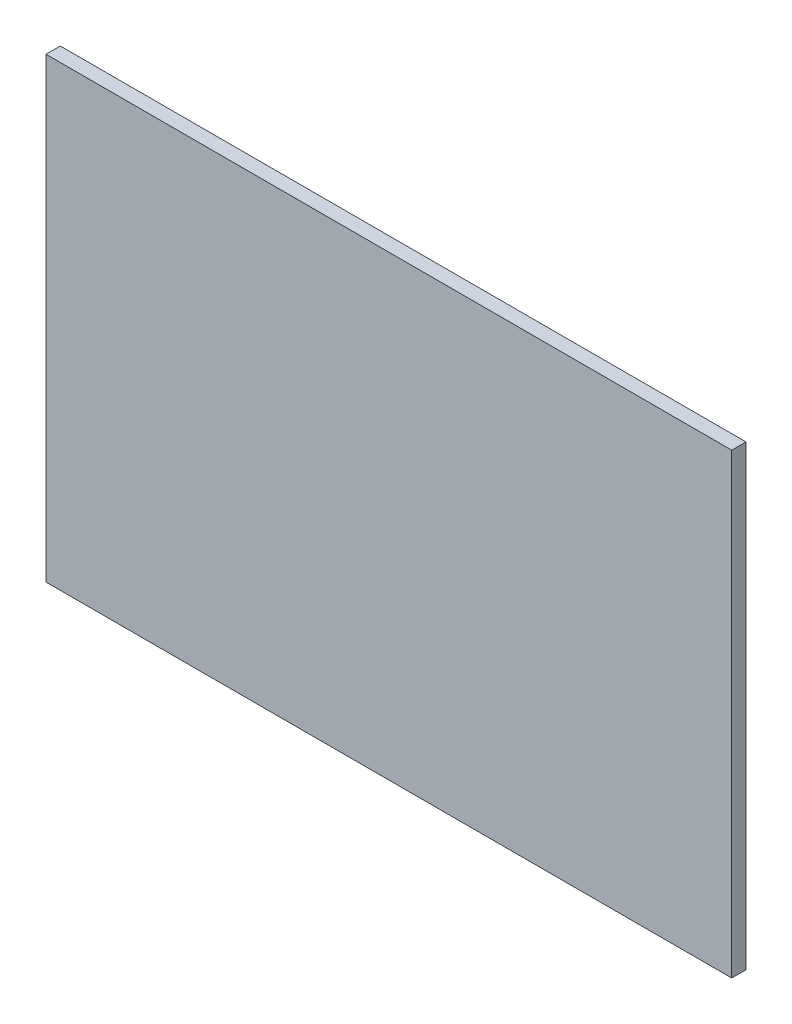
ISO-10303-21;
HEADER;
FILE_DESCRIPTION(('STEP AP214'),'2;1');
FILE_NAME('part.step','',(''),(''),'','','');
FILE_SCHEMA(('AUTOMOTIVE_DESIGN { 1 0 10303 214 1 1 1 1 }'));
ENDSEC;
DATA;
#1=APPLICATION_CONTEXT('core data for automotive mechanical design processes');
#2=APPLICATION_PROTOCOL_DEFINITION('international standard','automotive_design',2000,#1);
#3=PRODUCT_CONTEXT('',#1,'mechanical');
#4=PRODUCT('Part','Part','',(#3));
#5=PRODUCT_RELATED_PRODUCT_CATEGORY('part','',(#4));
#6=PRODUCT_DEFINITION_FORMATION('','',#4);
#7=PRODUCT_DEFINITION_CONTEXT('part definition',#1,'design');
#8=PRODUCT_DEFINITION('design','',#6,#7);
#9=PRODUCT_DEFINITION_SHAPE('','',#8);
#10=(LENGTH_UNIT() NAMED_UNIT(*) SI_UNIT(.MILLI.,.METRE.));
#11=(NAMED_UNIT(*) PLANE_ANGLE_UNIT() SI_UNIT($,.RADIAN.));
#12=(NAMED_UNIT(*) SI_UNIT($,.STERADIAN.) SOLID_ANGLE_UNIT());
#13=UNCERTAINTY_MEASURE_WITH_UNIT(LENGTH_MEASURE(1.E-05),#10,'distance_accuracy_value','');
#14=(GEOMETRIC_REPRESENTATION_CONTEXT(3) GLOBAL_UNCERTAINTY_ASSIGNED_CONTEXT((#13)) GLOBAL_UNIT_ASSIGNED_CONTEXT((#10,
#11,#12)) REPRESENTATION_CONTEXT('',''));
#15=CARTESIAN_POINT('',(0.,0.,0.));
#16=DIRECTION('',(0.,0.,1.));
#17=DIRECTION('',(1.,0.,0.));
#18=AXIS2_PLACEMENT_3D('',#15,#16,#17);
#19=CARTESIAN_POINT('',(0.,0.,6.35));
#20=DIRECTION('',(1.,0.,0.));
#21=DIRECTION('',(0.,0.,-1.));
#22=AXIS2_PLACEMENT_3D('',#19,#20,#21);
#23=PLANE('',#22);
#24=DIRECTION('',(0.,-1.,0.));
#25=VECTOR('',#24,1.);
#26=CARTESIAN_POINT('',(0.,0.,0.));
#27=LINE('',#26,#25);
#28=CARTESIAN_POINT('',(0.,203.2,0.));
#29=VERTEX_POINT('',#28);
#30=CARTESIAN_POINT('',(0.,0.,0.));
#31=VERTEX_POINT('',#30);
#32=EDGE_CURVE('E96',#29,#31,#27,.T.);
#33=ORIENTED_EDGE('',*,*,#32,.T.);
#34=DIRECTION('',(0.,0.,-1.));
#35=VECTOR('',#34,1.);
#36=CARTESIAN_POINT('',(0.,0.,6.35));
#37=LINE('',#36,#35);
#38=CARTESIAN_POINT('',(0.,0.,6.35));
#39=VERTEX_POINT('',#38);
#40=EDGE_CURVE('E11',#39,#31,#37,.T.);
#41=ORIENTED_EDGE('',*,*,#40,.F.);
#42=DIRECTION('',(0.,-1.,0.));
#43=VECTOR('',#42,1.);
#44=CARTESIAN_POINT('',(0.,0.,6.35));
#45=LINE('',#44,#43);
#46=CARTESIAN_POINT('',(0.,203.2,6.35));
#47=VERTEX_POINT('',#46);
#48=EDGE_CURVE('E84',#47,#39,#45,.T.);
#49=ORIENTED_EDGE('',*,*,#48,.F.);
#50=DIRECTION('',(0.,0.,-1.));
#51=VECTOR('',#50,1.);
#52=CARTESIAN_POINT('',(0.,203.2,6.35));
#53=LINE('',#52,#51);
#54=EDGE_CURVE('E92',#47,#29,#53,.T.);
#55=ORIENTED_EDGE('',*,*,#54,.T.);
#56=EDGE_LOOP('',(#33,#41,#49,#55));
#57=FACE_BOUND('',#56,.T.);
#58=ADVANCED_FACE('F33',(#57),#23,.F.);
#59=CARTESIAN_POINT('',(0.,0.,6.35));
#60=DIRECTION('',(0.,1.,0.));
#61=DIRECTION('',(0.,0.,1.));
#62=AXIS2_PLACEMENT_3D('',#59,#60,#61);
#63=PLANE('',#62);
#64=DIRECTION('',(1.,0.,0.));
#65=VECTOR('',#64,1.);
#66=CARTESIAN_POINT('',(0.,0.,0.));
#67=LINE('',#66,#65);
#68=CARTESIAN_POINT('',(304.8,0.,0.));
#69=VERTEX_POINT('',#68);
#70=EDGE_CURVE('E88',#31,#69,#67,.T.);
#71=ORIENTED_EDGE('',*,*,#70,.T.);
#72=DIRECTION('',(0.,0.,-1.));
#73=VECTOR('',#72,1.);
#74=CARTESIAN_POINT('',(304.8,0.,6.35));
#75=LINE('',#74,#73);
#76=CARTESIAN_POINT('',(304.8,0.,6.35));
#77=VERTEX_POINT('',#76);
#78=EDGE_CURVE('E41',#77,#69,#75,.T.);
#79=ORIENTED_EDGE('',*,*,#78,.F.);
#80=DIRECTION('',(1.,0.,0.));
#81=VECTOR('',#80,1.);
#82=CARTESIAN_POINT('',(0.,0.,6.35));
#83=LINE('',#82,#81);
#84=EDGE_CURVE('E79',#39,#77,#83,.T.);
#85=ORIENTED_EDGE('',*,*,#84,.F.);
#86=ORIENTED_EDGE('',*,*,#40,.T.);
#87=EDGE_LOOP('',(#71,#79,#85,#86));
#88=FACE_BOUND('',#87,.T.);
#89=ADVANCED_FACE('F87',(#88),#63,.F.);
#90=CARTESIAN_POINT('',(304.8,0.,6.35));
#91=DIRECTION('',(-1.,0.,0.));
#92=DIRECTION('',(0.,0.,1.));
#93=AXIS2_PLACEMENT_3D('',#90,#91,#92);
#94=PLANE('',#93);
#95=DIRECTION('',(0.,1.,0.));
#96=VECTOR('',#95,1.);
#97=CARTESIAN_POINT('',(304.8,0.,0.));
#98=LINE('',#97,#96);
#99=CARTESIAN_POINT('',(304.8,203.2,0.));
#100=VERTEX_POINT('',#99);
#101=EDGE_CURVE('E66',#69,#100,#98,.T.);
#102=ORIENTED_EDGE('',*,*,#101,.T.);
#103=DIRECTION('',(0.,0.,-1.));
#104=VECTOR('',#103,1.);
#105=CARTESIAN_POINT('',(304.8,203.2,6.35));
#106=LINE('',#105,#104);
#107=CARTESIAN_POINT('',(304.8,203.2,6.35));
#108=VERTEX_POINT('',#107);
#109=EDGE_CURVE('E89',#108,#100,#106,.T.);
#110=ORIENTED_EDGE('',*,*,#109,.F.);
#111=DIRECTION('',(0.,1.,0.));
#112=VECTOR('',#111,1.);
#113=CARTESIAN_POINT('',(304.8,0.,6.35));
#114=LINE('',#113,#112);
#115=EDGE_CURVE('E82',#77,#108,#114,.T.);
#116=ORIENTED_EDGE('',*,*,#115,.F.);
#117=ORIENTED_EDGE('',*,*,#78,.T.);
#118=EDGE_LOOP('',(#102,#110,#116,#117));
#119=FACE_BOUND('',#118,.T.);
#120=ADVANCED_FACE('F90',(#119),#94,.F.);
#121=CARTESIAN_POINT('',(0.,203.2,6.35));
#122=DIRECTION('',(0.,-1.,0.));
#123=DIRECTION('',(0.,0.,-1.));
#124=AXIS2_PLACEMENT_3D('',#121,#122,#123);
#125=PLANE('',#124);
#126=DIRECTION('',(-1.,0.,0.));
#127=VECTOR('',#126,1.);
#128=CARTESIAN_POINT('',(0.,203.2,0.));
#129=LINE('',#128,#127);
#130=EDGE_CURVE('E72',#100,#29,#129,.T.);
#131=ORIENTED_EDGE('',*,*,#130,.T.);
#132=ORIENTED_EDGE('',*,*,#54,.F.);
#133=DIRECTION('',(-1.,0.,0.));
#134=VECTOR('',#133,1.);
#135=CARTESIAN_POINT('',(0.,203.2,6.35));
#136=LINE('',#135,#134);
#137=EDGE_CURVE('E49',#108,#47,#136,.T.);
#138=ORIENTED_EDGE('',*,*,#137,.F.);
#139=ORIENTED_EDGE('',*,*,#109,.T.);
#140=EDGE_LOOP('',(#131,#132,#138,#139));
#141=FACE_BOUND('',#140,.T.);
#142=ADVANCED_FACE('F103',(#141),#125,.F.);
#143=CARTESIAN_POINT('',(0.,0.,6.35));
#144=DIRECTION('',(0.,0.,-1.));
#145=DIRECTION('',(-1.,0.,0.));
#146=AXIS2_PLACEMENT_3D('',#143,#144,#145);
#147=PLANE('',#146);
#148=ORIENTED_EDGE('',*,*,#48,.T.);
#149=ORIENTED_EDGE('',*,*,#84,.T.);
#150=ORIENTED_EDGE('',*,*,#115,.T.);
#151=ORIENTED_EDGE('',*,*,#137,.T.);
#152=EDGE_LOOP('',(#148,#149,#150,#151));
#153=FACE_BOUND('',#152,.T.);
#154=ADVANCED_FACE('F80',(#153),#147,.F.);
#155=CARTESIAN_POINT('',(0.,0.,0.));
#156=DIRECTION('',(0.,0.,-1.));
#157=DIRECTION('',(-1.,0.,0.));
#158=AXIS2_PLACEMENT_3D('',#155,#156,#157);
#159=PLANE('',#158);
#160=ORIENTED_EDGE('',*,*,#32,.F.);
#161=ORIENTED_EDGE('',*,*,#130,.F.);
#162=ORIENTED_EDGE('',*,*,#101,.F.);
#163=ORIENTED_EDGE('',*,*,#70,.F.);
#164=EDGE_LOOP('',(#160,#161,#162,#163));
#165=FACE_BOUND('',#164,.T.);
#166=ADVANCED_FACE('F106',(#165),#159,.T.);
#167=CLOSED_SHELL('',(#58,#89,#120,#142,#154,#166));
#168=MANIFOLD_SOLID_BREP('B2',#167);
#169=ADVANCED_BREP_SHAPE_REPRESENTATION('',(#18,#168),#14);
#170=SHAPE_DEFINITION_REPRESENTATION(#9,#169);
ENDSEC;
END-ISO-10303-21;
